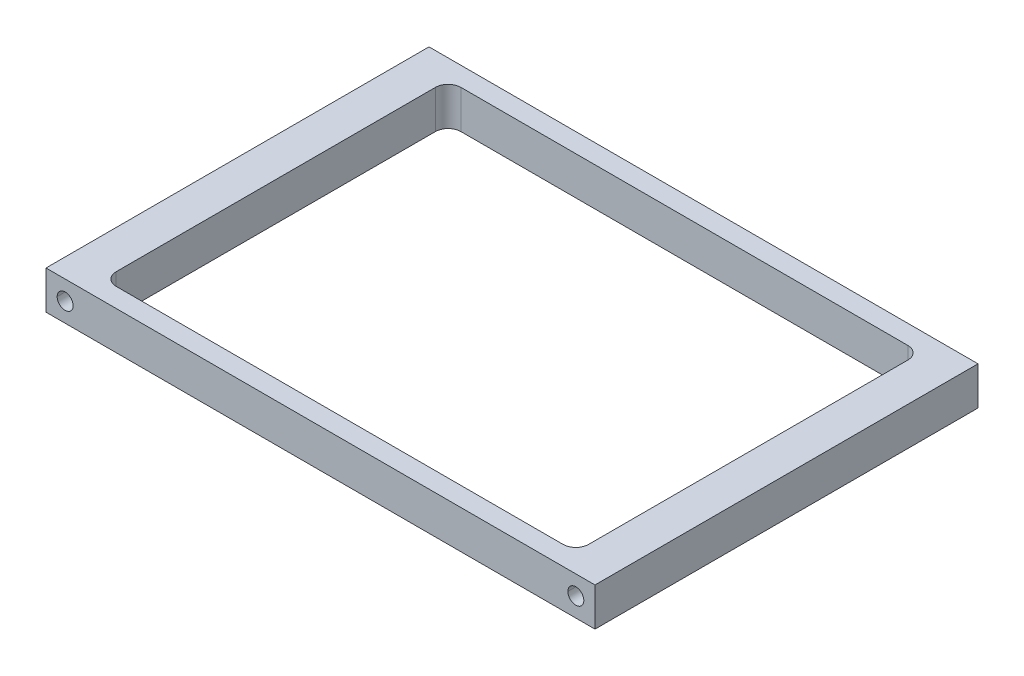
ISO-10303-21;
HEADER;
FILE_DESCRIPTION(('STEP AP214'),'2;1');
FILE_NAME('part.step','',(''),(''),'','','');
FILE_SCHEMA(('AUTOMOTIVE_DESIGN { 1 0 10303 214 1 1 1 1 }'));
ENDSEC;
DATA;
#1=APPLICATION_CONTEXT('core data for automotive mechanical design processes');
#2=APPLICATION_PROTOCOL_DEFINITION('international standard','automotive_design',2000,#1);
#3=PRODUCT_CONTEXT('',#1,'mechanical');
#4=PRODUCT('Part','Part','',(#3));
#5=PRODUCT_RELATED_PRODUCT_CATEGORY('part','',(#4));
#6=PRODUCT_DEFINITION_FORMATION('','',#4);
#7=PRODUCT_DEFINITION_CONTEXT('part definition',#1,'design');
#8=PRODUCT_DEFINITION('design','',#6,#7);
#9=PRODUCT_DEFINITION_SHAPE('','',#8);
#10=(LENGTH_UNIT() NAMED_UNIT(*) SI_UNIT(.MILLI.,.METRE.));
#11=(NAMED_UNIT(*) PLANE_ANGLE_UNIT() SI_UNIT($,.RADIAN.));
#12=(NAMED_UNIT(*) SI_UNIT($,.STERADIAN.) SOLID_ANGLE_UNIT());
#13=UNCERTAINTY_MEASURE_WITH_UNIT(LENGTH_MEASURE(1.E-05),#10,'distance_accuracy_value','');
#14=(GEOMETRIC_REPRESENTATION_CONTEXT(3) GLOBAL_UNCERTAINTY_ASSIGNED_CONTEXT((#13)) GLOBAL_UNIT_ASSIGNED_CONTEXT((#10,
#11,#12)) REPRESENTATION_CONTEXT('',''));
#15=CARTESIAN_POINT('',(0.,0.,0.));
#16=DIRECTION('',(0.,0.,1.));
#17=DIRECTION('',(1.,0.,0.));
#18=AXIS2_PLACEMENT_3D('',#15,#16,#17);
#19=CARTESIAN_POINT('',(-35.,0.,-25.));
#20=DIRECTION('',(0.,-1.,0.));
#21=DIRECTION('',(0.,0.,-1.));
#22=AXIS2_PLACEMENT_3D('',#19,#20,#21);
#23=CYLINDRICAL_SURFACE('',#22,2.);
#24=CARTESIAN_POINT('',(-35.,0.,-25.));
#25=DIRECTION('',(0.,1.,0.));
#26=DIRECTION('',(0.,0.,-1.));
#27=AXIS2_PLACEMENT_3D('',#24,#25,#26);
#28=CIRCLE('',#27,2.);
#29=CARTESIAN_POINT('',(-35.,0.,-27.));
#30=VERTEX_POINT('',#29);
#31=CARTESIAN_POINT('',(-37.,0.,-25.));
#32=VERTEX_POINT('',#31);
#33=EDGE_CURVE('E376',#30,#32,#28,.T.);
#34=ORIENTED_EDGE('',*,*,#33,.F.);
#35=DIRECTION('',(0.,-1.,0.));
#36=VECTOR('',#35,1.);
#37=CARTESIAN_POINT('',(-35.,0.,-27.));
#38=LINE('',#37,#36);
#39=CARTESIAN_POINT('',(-35.,6.,-27.));
#40=VERTEX_POINT('',#39);
#41=EDGE_CURVE('E10',#40,#30,#38,.T.);
#42=ORIENTED_EDGE('',*,*,#41,.F.);
#43=CARTESIAN_POINT('',(-35.,6.,-25.));
#44=DIRECTION('',(0.,-1.,0.));
#45=DIRECTION('',(0.,0.,-1.));
#46=AXIS2_PLACEMENT_3D('',#43,#44,#45);
#47=CIRCLE('',#46,2.);
#48=CARTESIAN_POINT('',(-37.,6.,-25.));
#49=VERTEX_POINT('',#48);
#50=EDGE_CURVE('E441',#49,#40,#47,.T.);
#51=ORIENTED_EDGE('',*,*,#50,.F.);
#52=DIRECTION('',(0.,1.,0.));
#53=VECTOR('',#52,1.);
#54=CARTESIAN_POINT('',(-37.,6.,-25.));
#55=LINE('',#54,#53);
#56=EDGE_CURVE('E50',#32,#49,#55,.T.);
#57=ORIENTED_EDGE('',*,*,#56,.F.);
#58=EDGE_LOOP('',(#34,#42,#51,#57));
#59=FACE_BOUND('',#58,.T.);
#60=ADVANCED_FACE('F16',(#59),#23,.F.);
#61=CARTESIAN_POINT('',(35.,0.,-25.));
#62=DIRECTION('',(0.,-1.,0.));
#63=DIRECTION('',(0.,0.,-1.));
#64=AXIS2_PLACEMENT_3D('',#61,#62,#63);
#65=CYLINDRICAL_SURFACE('',#64,2.);
#66=CARTESIAN_POINT('',(35.,0.,-25.));
#67=DIRECTION('',(0.,1.,0.));
#68=DIRECTION('',(0.,0.,-1.));
#69=AXIS2_PLACEMENT_3D('',#66,#67,#68);
#70=CIRCLE('',#69,2.);
#71=CARTESIAN_POINT('',(37.,0.,-25.));
#72=VERTEX_POINT('',#71);
#73=CARTESIAN_POINT('',(35.,0.,-27.));
#74=VERTEX_POINT('',#73);
#75=EDGE_CURVE('E415',#72,#74,#70,.T.);
#76=ORIENTED_EDGE('',*,*,#75,.F.);
#77=DIRECTION('',(0.,-1.,0.));
#78=VECTOR('',#77,1.);
#79=CARTESIAN_POINT('',(37.,0.,-25.));
#80=LINE('',#79,#78);
#81=CARTESIAN_POINT('',(37.,6.,-25.));
#82=VERTEX_POINT('',#81);
#83=EDGE_CURVE('E321',#82,#72,#80,.T.);
#84=ORIENTED_EDGE('',*,*,#83,.F.);
#85=CARTESIAN_POINT('',(35.,6.,-25.));
#86=DIRECTION('',(0.,-1.,0.));
#87=DIRECTION('',(0.,0.,-1.));
#88=AXIS2_PLACEMENT_3D('',#85,#86,#87);
#89=CIRCLE('',#88,2.);
#90=CARTESIAN_POINT('',(35.,6.,-27.));
#91=VERTEX_POINT('',#90);
#92=EDGE_CURVE('E265',#91,#82,#89,.T.);
#93=ORIENTED_EDGE('',*,*,#92,.F.);
#94=DIRECTION('',(0.,1.,0.));
#95=VECTOR('',#94,1.);
#96=CARTESIAN_POINT('',(35.,6.,-27.));
#97=LINE('',#96,#95);
#98=EDGE_CURVE('E20',#74,#91,#97,.T.);
#99=ORIENTED_EDGE('',*,*,#98,.F.);
#100=EDGE_LOOP('',(#76,#84,#93,#99));
#101=FACE_BOUND('',#100,.T.);
#102=ADVANCED_FACE('F18',(#101),#65,.F.);
#103=CARTESIAN_POINT('',(-35.,0.,25.));
#104=DIRECTION('',(0.,-1.,0.));
#105=DIRECTION('',(0.,0.,-1.));
#106=AXIS2_PLACEMENT_3D('',#103,#104,#105);
#107=CYLINDRICAL_SURFACE('',#106,2.);
#108=CARTESIAN_POINT('',(-35.,0.,25.));
#109=DIRECTION('',(0.,1.,0.));
#110=DIRECTION('',(0.,0.,-1.));
#111=AXIS2_PLACEMENT_3D('',#108,#109,#110);
#112=CIRCLE('',#111,2.);
#113=CARTESIAN_POINT('',(-37.,0.,25.));
#114=VERTEX_POINT('',#113);
#115=CARTESIAN_POINT('',(-35.,0.,27.));
#116=VERTEX_POINT('',#115);
#117=EDGE_CURVE('E460',#114,#116,#112,.T.);
#118=ORIENTED_EDGE('',*,*,#117,.F.);
#119=DIRECTION('',(0.,-1.,0.));
#120=VECTOR('',#119,1.);
#121=CARTESIAN_POINT('',(-37.,0.,25.));
#122=LINE('',#121,#120);
#123=CARTESIAN_POINT('',(-37.,6.,25.));
#124=VERTEX_POINT('',#123);
#125=EDGE_CURVE('E39',#124,#114,#122,.T.);
#126=ORIENTED_EDGE('',*,*,#125,.F.);
#127=CARTESIAN_POINT('',(-35.,6.,25.));
#128=DIRECTION('',(0.,-1.,0.));
#129=DIRECTION('',(0.,0.,-1.));
#130=AXIS2_PLACEMENT_3D('',#127,#128,#129);
#131=CIRCLE('',#130,2.);
#132=CARTESIAN_POINT('',(-35.,6.,27.));
#133=VERTEX_POINT('',#132);
#134=EDGE_CURVE('E427',#133,#124,#131,.T.);
#135=ORIENTED_EDGE('',*,*,#134,.F.);
#136=DIRECTION('',(0.,1.,0.));
#137=VECTOR('',#136,1.);
#138=CARTESIAN_POINT('',(-35.,6.,27.));
#139=LINE('',#138,#137);
#140=EDGE_CURVE('E332',#116,#133,#139,.T.);
#141=ORIENTED_EDGE('',*,*,#140,.F.);
#142=EDGE_LOOP('',(#118,#126,#135,#141));
#143=FACE_BOUND('',#142,.T.);
#144=ADVANCED_FACE('F504',(#143),#107,.F.);
#145=CARTESIAN_POINT('',(35.,0.,25.));
#146=DIRECTION('',(0.,-1.,0.));
#147=DIRECTION('',(0.,0.,-1.));
#148=AXIS2_PLACEMENT_3D('',#145,#146,#147);
#149=CYLINDRICAL_SURFACE('',#148,2.);
#150=CARTESIAN_POINT('',(35.,0.,25.));
#151=DIRECTION('',(0.,1.,0.));
#152=DIRECTION('',(0.,0.,-1.));
#153=AXIS2_PLACEMENT_3D('',#150,#151,#152);
#154=CIRCLE('',#153,2.);
#155=CARTESIAN_POINT('',(35.,0.,27.));
#156=VERTEX_POINT('',#155);
#157=CARTESIAN_POINT('',(37.,0.,25.));
#158=VERTEX_POINT('',#157);
#159=EDGE_CURVE('E438',#156,#158,#154,.T.);
#160=ORIENTED_EDGE('',*,*,#159,.F.);
#161=DIRECTION('',(0.,-1.,0.));
#162=VECTOR('',#161,1.);
#163=CARTESIAN_POINT('',(35.,0.,27.));
#164=LINE('',#163,#162);
#165=CARTESIAN_POINT('',(35.,6.,27.));
#166=VERTEX_POINT('',#165);
#167=EDGE_CURVE('E432',#166,#156,#164,.T.);
#168=ORIENTED_EDGE('',*,*,#167,.F.);
#169=CARTESIAN_POINT('',(35.,6.,25.));
#170=DIRECTION('',(0.,-1.,0.));
#171=DIRECTION('',(0.,0.,-1.));
#172=AXIS2_PLACEMENT_3D('',#169,#170,#171);
#173=CIRCLE('',#172,2.);
#174=CARTESIAN_POINT('',(37.,6.,25.));
#175=VERTEX_POINT('',#174);
#176=EDGE_CURVE('E394',#175,#166,#173,.T.);
#177=ORIENTED_EDGE('',*,*,#176,.F.);
#178=DIRECTION('',(0.,1.,0.));
#179=VECTOR('',#178,1.);
#180=CARTESIAN_POINT('',(37.,6.,25.));
#181=LINE('',#180,#179);
#182=EDGE_CURVE('E230',#158,#175,#181,.T.);
#183=ORIENTED_EDGE('',*,*,#182,.F.);
#184=EDGE_LOOP('',(#160,#168,#177,#183));
#185=FACE_BOUND('',#184,.T.);
#186=ADVANCED_FACE('F498',(#185),#149,.F.);
#187=CARTESIAN_POINT('',(-37.,0.,-27.));
#188=DIRECTION('',(0.,0.,-1.));
#189=DIRECTION('',(0.,-1.,0.));
#190=AXIS2_PLACEMENT_3D('',#187,#188,#189);
#191=PLANE('',#190);
#192=DIRECTION('',(-1.,0.,0.));
#193=VECTOR('',#192,1.);
#194=CARTESIAN_POINT('',(-37.,0.,-27.));
#195=LINE('',#194,#193);
#196=EDGE_CURVE('E381',#74,#30,#195,.T.);
#197=ORIENTED_EDGE('',*,*,#196,.F.);
#198=ORIENTED_EDGE('',*,*,#98,.T.);
#199=DIRECTION('',(-1.,0.,0.));
#200=VECTOR('',#199,1.);
#201=CARTESIAN_POINT('',(-37.,6.,-27.));
#202=LINE('',#201,#200);
#203=EDGE_CURVE('E263',#91,#40,#202,.T.);
#204=ORIENTED_EDGE('',*,*,#203,.T.);
#205=ORIENTED_EDGE('',*,*,#41,.T.);
#206=EDGE_LOOP('',(#197,#198,#204,#205));
#207=FACE_BOUND('',#206,.T.);
#208=ADVANCED_FACE('F479',(#207),#191,.F.);
#209=CARTESIAN_POINT('',(-37.,0.,27.));
#210=DIRECTION('',(-1.,0.,0.));
#211=DIRECTION('',(0.,0.,1.));
#212=AXIS2_PLACEMENT_3D('',#209,#210,#211);
#213=PLANE('',#212);
#214=DIRECTION('',(0.,0.,1.));
#215=VECTOR('',#214,1.);
#216=CARTESIAN_POINT('',(-37.,6.,27.));
#217=LINE('',#216,#215);
#218=EDGE_CURVE('E431',#49,#124,#217,.T.);
#219=ORIENTED_EDGE('',*,*,#218,.T.);
#220=ORIENTED_EDGE('',*,*,#125,.T.);
#221=DIRECTION('',(0.,0.,1.));
#222=VECTOR('',#221,1.);
#223=CARTESIAN_POINT('',(-37.,0.,27.));
#224=LINE('',#223,#222);
#225=EDGE_CURVE('E380',#32,#114,#224,.T.);
#226=ORIENTED_EDGE('',*,*,#225,.F.);
#227=ORIENTED_EDGE('',*,*,#56,.T.);
#228=EDGE_LOOP('',(#219,#220,#226,#227));
#229=FACE_BOUND('',#228,.T.);
#230=ADVANCED_FACE('F505',(#229),#213,.F.);
#231=CARTESIAN_POINT('',(-37.,0.,27.));
#232=DIRECTION('',(0.,0.,1.));
#233=DIRECTION('',(1.,0.,0.));
#234=AXIS2_PLACEMENT_3D('',#231,#232,#233);
#235=PLANE('',#234);
#236=DIRECTION('',(1.,0.,0.));
#237=VECTOR('',#236,1.);
#238=CARTESIAN_POINT('',(-37.,6.,27.));
#239=LINE('',#238,#237);
#240=EDGE_CURVE('E423',#133,#166,#239,.T.);
#241=ORIENTED_EDGE('',*,*,#240,.T.);
#242=ORIENTED_EDGE('',*,*,#167,.T.);
#243=DIRECTION('',(1.,0.,0.));
#244=VECTOR('',#243,1.);
#245=CARTESIAN_POINT('',(-37.,0.,27.));
#246=LINE('',#245,#244);
#247=EDGE_CURVE('E447',#116,#156,#246,.T.);
#248=ORIENTED_EDGE('',*,*,#247,.F.);
#249=ORIENTED_EDGE('',*,*,#140,.T.);
#250=EDGE_LOOP('',(#241,#242,#248,#249));
#251=FACE_BOUND('',#250,.T.);
#252=ADVANCED_FACE('F501',(#251),#235,.F.);
#253=CARTESIAN_POINT('',(37.,0.,27.));
#254=DIRECTION('',(1.,0.,0.));
#255=DIRECTION('',(0.,1.,0.));
#256=AXIS2_PLACEMENT_3D('',#253,#254,#255);
#257=PLANE('',#256);
#258=DIRECTION('',(0.,0.,-1.));
#259=VECTOR('',#258,1.);
#260=CARTESIAN_POINT('',(37.,0.,27.));
#261=LINE('',#260,#259);
#262=EDGE_CURVE('E419',#158,#72,#261,.T.);
#263=ORIENTED_EDGE('',*,*,#262,.F.);
#264=ORIENTED_EDGE('',*,*,#182,.T.);
#265=DIRECTION('',(0.,0.,-1.));
#266=VECTOR('',#265,1.);
#267=CARTESIAN_POINT('',(37.,6.,27.));
#268=LINE('',#267,#266);
#269=EDGE_CURVE('E390',#175,#82,#268,.T.);
#270=ORIENTED_EDGE('',*,*,#269,.T.);
#271=ORIENTED_EDGE('',*,*,#83,.T.);
#272=EDGE_LOOP('',(#263,#264,#270,#271));
#273=FACE_BOUND('',#272,.T.);
#274=ADVANCED_FACE('F494',(#273),#257,.F.);
#275=CARTESIAN_POINT('',(-40.,3.,-30.));
#276=DIRECTION('',(0.,0.,-1.));
#277=DIRECTION('',(-1.,0.,0.));
#278=AXIS2_PLACEMENT_3D('',#275,#276,#277);
#279=CYLINDRICAL_SURFACE('',#278,1.25);
#280=DIRECTION('',(0.,0.,-1.));
#281=VECTOR('',#280,1.);
#282=CARTESIAN_POINT('',(-38.75,3.,-30.));
#283=LINE('',#282,#281);
#284=CARTESIAN_POINT('',(-38.75,3.,-14.));
#285=VERTEX_POINT('',#284);
#286=CARTESIAN_POINT('',(-38.75,3.,-30.));
#287=VERTEX_POINT('',#286);
#288=EDGE_CURVE('E242',#285,#287,#283,.T.);
#289=ORIENTED_EDGE('',*,*,#288,.F.);
#290=CARTESIAN_POINT('',(-40.,3.,-14.));
#291=DIRECTION('',(0.,0.,-1.));
#292=DIRECTION('',(-1.,0.,0.));
#293=AXIS2_PLACEMENT_3D('',#290,#291,#292);
#294=CIRCLE('',#293,1.25);
#295=CARTESIAN_POINT('',(-41.25,3.,-14.));
#296=VERTEX_POINT('',#295);
#297=EDGE_CURVE('E219',#296,#285,#294,.T.);
#298=ORIENTED_EDGE('',*,*,#297,.F.);
#299=DIRECTION('',(0.,0.,-1.));
#300=VECTOR('',#299,1.);
#301=CARTESIAN_POINT('',(-41.25,3.,-30.));
#302=LINE('',#301,#300);
#303=CARTESIAN_POINT('',(-41.25,3.,-30.));
#304=VERTEX_POINT('',#303);
#305=EDGE_CURVE('E252',#296,#304,#302,.T.);
#306=ORIENTED_EDGE('',*,*,#305,.T.);
#307=CARTESIAN_POINT('',(-40.,3.,-30.));
#308=DIRECTION('',(0.,0.,-1.));
#309=DIRECTION('',(-1.,0.,0.));
#310=AXIS2_PLACEMENT_3D('',#307,#308,#309);
#311=CIRCLE('',#310,1.24999999999999);
#312=EDGE_CURVE('E244',#304,#287,#311,.T.);
#313=ORIENTED_EDGE('',*,*,#312,.T.);
#314=EDGE_LOOP('',(#289,#298,#306,#313));
#315=FACE_BOUND('',#314,.T.);
#316=ADVANCED_FACE('F243',(#315),#279,.F.);
#317=CARTESIAN_POINT('',(-40.,3.,-14.));
#318=DIRECTION('',(0.,0.,-1.));
#319=DIRECTION('',(-1.,0.,0.));
#320=AXIS2_PLACEMENT_3D('',#317,#318,#319);
#321=CONICAL_SURFACE('',#320,1.25,1.02974425867665);
#322=DIRECTION('',(0.85716730070211,0.,-0.515038074910058));
#323=VECTOR('',#322,1.);
#324=CARTESIAN_POINT('',(-38.75,3.,-14.));
#325=LINE('',#324,#323);
#326=CARTESIAN_POINT('',(-40.,3.,-13.2489242262155));
#327=VERTEX_POINT('',#326);
#328=EDGE_CURVE('E222',#327,#285,#325,.T.);
#329=ORIENTED_EDGE('',*,*,#328,.F.);
#330=DIRECTION('',(-0.85716730070211,0.,-0.515038074910058));
#331=VECTOR('',#330,1.);
#332=CARTESIAN_POINT('',(-41.25,3.,-14.));
#333=LINE('',#332,#331);
#334=EDGE_CURVE('E224',#327,#296,#333,.T.);
#335=ORIENTED_EDGE('',*,*,#334,.T.);
#336=ORIENTED_EDGE('',*,*,#297,.T.);
#337=EDGE_LOOP('',(#329,#335,#336));
#338=FACE_BOUND('',#337,.T.);
#339=ADVANCED_FACE('F221',(#338),#321,.F.);
#340=CARTESIAN_POINT('',(40.,3.,-30.));
#341=DIRECTION('',(0.,0.,-1.));
#342=DIRECTION('',(-1.,0.,0.));
#343=AXIS2_PLACEMENT_3D('',#340,#341,#342);
#344=CYLINDRICAL_SURFACE('',#343,1.25);
#345=DIRECTION('',(0.,0.,-1.));
#346=VECTOR('',#345,1.);
#347=CARTESIAN_POINT('',(41.25,3.,-30.));
#348=LINE('',#347,#346);
#349=CARTESIAN_POINT('',(41.25,3.,-14.));
#350=VERTEX_POINT('',#349);
#351=CARTESIAN_POINT('',(41.25,3.,-30.));
#352=VERTEX_POINT('',#351);
#353=EDGE_CURVE('E299',#350,#352,#348,.T.);
#354=ORIENTED_EDGE('',*,*,#353,.F.);
#355=CARTESIAN_POINT('',(40.,3.,-14.));
#356=DIRECTION('',(0.,0.,-1.));
#357=DIRECTION('',(-1.,0.,0.));
#358=AXIS2_PLACEMENT_3D('',#355,#356,#357);
#359=CIRCLE('',#358,1.25);
#360=CARTESIAN_POINT('',(38.75,3.,-14.));
#361=VERTEX_POINT('',#360);
#362=EDGE_CURVE('E231',#361,#350,#359,.T.);
#363=ORIENTED_EDGE('',*,*,#362,.F.);
#364=DIRECTION('',(0.,0.,-1.));
#365=VECTOR('',#364,1.);
#366=CARTESIAN_POINT('',(38.75,3.,-30.));
#367=LINE('',#366,#365);
#368=CARTESIAN_POINT('',(38.75,3.,-30.));
#369=VERTEX_POINT('',#368);
#370=EDGE_CURVE('E280',#361,#369,#367,.T.);
#371=ORIENTED_EDGE('',*,*,#370,.T.);
#372=CARTESIAN_POINT('',(40.,3.,-30.));
#373=DIRECTION('',(0.,0.,-1.));
#374=DIRECTION('',(-1.,0.,0.));
#375=AXIS2_PLACEMENT_3D('',#372,#373,#374);
#376=CIRCLE('',#375,1.24999999999999);
#377=EDGE_CURVE('E364',#369,#352,#376,.T.);
#378=ORIENTED_EDGE('',*,*,#377,.T.);
#379=EDGE_LOOP('',(#354,#363,#371,#378));
#380=FACE_BOUND('',#379,.T.);
#381=ADVANCED_FACE('F532',(#380),#344,.F.);
#382=CARTESIAN_POINT('',(40.,3.,-14.));
#383=DIRECTION('',(0.,0.,-1.));
#384=DIRECTION('',(-1.,0.,0.));
#385=AXIS2_PLACEMENT_3D('',#382,#383,#384);
#386=CONICAL_SURFACE('',#385,1.25,1.02974425867665);
#387=DIRECTION('',(0.85716730070211,0.,-0.515038074910058));
#388=VECTOR('',#387,1.);
#389=CARTESIAN_POINT('',(41.25,3.,-14.));
#390=LINE('',#389,#388);
#391=CARTESIAN_POINT('',(40.,3.,-13.2489242262155));
#392=VERTEX_POINT('',#391);
#393=EDGE_CURVE('E273',#392,#350,#390,.T.);
#394=ORIENTED_EDGE('',*,*,#393,.F.);
#395=DIRECTION('',(-0.85716730070211,0.,-0.515038074910058));
#396=VECTOR('',#395,1.);
#397=CARTESIAN_POINT('',(38.75,3.,-14.));
#398=LINE('',#397,#396);
#399=EDGE_CURVE('E284',#392,#361,#398,.T.);
#400=ORIENTED_EDGE('',*,*,#399,.T.);
#401=ORIENTED_EDGE('',*,*,#362,.T.);
#402=EDGE_LOOP('',(#394,#400,#401));
#403=FACE_BOUND('',#402,.T.);
#404=ADVANCED_FACE('F528',(#403),#386,.F.);
#405=CARTESIAN_POINT('',(-40.,3.,30.));
#406=DIRECTION('',(0.,0.,1.));
#407=DIRECTION('',(1.,0.,0.));
#408=AXIS2_PLACEMENT_3D('',#405,#406,#407);
#409=CYLINDRICAL_SURFACE('',#408,1.25);
#410=DIRECTION('',(0.,0.,1.));
#411=VECTOR('',#410,1.);
#412=CARTESIAN_POINT('',(-41.25,3.,30.));
#413=LINE('',#412,#411);
#414=CARTESIAN_POINT('',(-41.25,3.,14.));
#415=VERTEX_POINT('',#414);
#416=CARTESIAN_POINT('',(-41.25,3.,30.));
#417=VERTEX_POINT('',#416);
#418=EDGE_CURVE('E272',#415,#417,#413,.T.);
#419=ORIENTED_EDGE('',*,*,#418,.F.);
#420=CARTESIAN_POINT('',(-40.,3.,14.));
#421=DIRECTION('',(0.,0.,1.));
#422=DIRECTION('',(1.,0.,0.));
#423=AXIS2_PLACEMENT_3D('',#420,#421,#422);
#424=CIRCLE('',#423,1.25);
#425=CARTESIAN_POINT('',(-38.75,3.,14.));
#426=VERTEX_POINT('',#425);
#427=EDGE_CURVE('E286',#426,#415,#424,.T.);
#428=ORIENTED_EDGE('',*,*,#427,.F.);
#429=DIRECTION('',(0.,0.,1.));
#430=VECTOR('',#429,1.);
#431=CARTESIAN_POINT('',(-38.75,3.,30.));
#432=LINE('',#431,#430);
#433=CARTESIAN_POINT('',(-38.75,3.,30.));
#434=VERTEX_POINT('',#433);
#435=EDGE_CURVE('E312',#426,#434,#432,.T.);
#436=ORIENTED_EDGE('',*,*,#435,.T.);
#437=CARTESIAN_POINT('',(-40.,3.,30.));
#438=DIRECTION('',(0.,0.,1.));
#439=DIRECTION('',(1.,0.,0.));
#440=AXIS2_PLACEMENT_3D('',#437,#438,#439);
#441=CIRCLE('',#440,1.24999999999999);
#442=EDGE_CURVE('E306',#434,#417,#441,.T.);
#443=ORIENTED_EDGE('',*,*,#442,.T.);
#444=EDGE_LOOP('',(#419,#428,#436,#443));
#445=FACE_BOUND('',#444,.T.);
#446=ADVANCED_FACE('F525',(#445),#409,.F.);
#447=CARTESIAN_POINT('',(-40.,3.,14.));
#448=DIRECTION('',(0.,0.,1.));
#449=DIRECTION('',(1.,0.,0.));
#450=AXIS2_PLACEMENT_3D('',#447,#448,#449);
#451=CONICAL_SURFACE('',#450,1.25,1.02974425867665);
#452=DIRECTION('',(-0.85716730070211,0.,0.515038074910058));
#453=VECTOR('',#452,1.);
#454=CARTESIAN_POINT('',(-41.25,3.,14.));
#455=LINE('',#454,#453);
#456=CARTESIAN_POINT('',(-40.,3.,13.2489242262155));
#457=VERTEX_POINT('',#456);
#458=EDGE_CURVE('E329',#457,#415,#455,.T.);
#459=ORIENTED_EDGE('',*,*,#458,.F.);
#460=DIRECTION('',(0.85716730070211,0.,0.515038074910058));
#461=VECTOR('',#460,1.);
#462=CARTESIAN_POINT('',(-38.75,3.,14.));
#463=LINE('',#462,#461);
#464=EDGE_CURVE('E325',#457,#426,#463,.T.);
#465=ORIENTED_EDGE('',*,*,#464,.T.);
#466=ORIENTED_EDGE('',*,*,#427,.T.);
#467=EDGE_LOOP('',(#459,#465,#466));
#468=FACE_BOUND('',#467,.T.);
#469=ADVANCED_FACE('F523',(#468),#451,.F.);
#470=CARTESIAN_POINT('',(40.,3.,30.));
#471=DIRECTION('',(0.,0.,1.));
#472=DIRECTION('',(1.,0.,0.));
#473=AXIS2_PLACEMENT_3D('',#470,#471,#472);
#474=CYLINDRICAL_SURFACE('',#473,1.25);
#475=DIRECTION('',(0.,0.,1.));
#476=VECTOR('',#475,1.);
#477=CARTESIAN_POINT('',(38.75,3.,30.));
#478=LINE('',#477,#476);
#479=CARTESIAN_POINT('',(38.75,3.,14.));
#480=VERTEX_POINT('',#479);
#481=CARTESIAN_POINT('',(38.75,3.,30.));
#482=VERTEX_POINT('',#481);
#483=EDGE_CURVE('E290',#480,#482,#478,.T.);
#484=ORIENTED_EDGE('',*,*,#483,.F.);
#485=CARTESIAN_POINT('',(40.,3.,14.));
#486=DIRECTION('',(0.,0.,1.));
#487=DIRECTION('',(1.,0.,0.));
#488=AXIS2_PLACEMENT_3D('',#485,#486,#487);
#489=CIRCLE('',#488,1.25);
#490=CARTESIAN_POINT('',(41.25,3.,14.));
#491=VERTEX_POINT('',#490);
#492=EDGE_CURVE('E289',#491,#480,#489,.T.);
#493=ORIENTED_EDGE('',*,*,#492,.F.);
#494=DIRECTION('',(0.,0.,1.));
#495=VECTOR('',#494,1.);
#496=CARTESIAN_POINT('',(41.25,3.,30.));
#497=LINE('',#496,#495);
#498=CARTESIAN_POINT('',(41.25,3.,30.));
#499=VERTEX_POINT('',#498);
#500=EDGE_CURVE('E261',#491,#499,#497,.T.);
#501=ORIENTED_EDGE('',*,*,#500,.T.);
#502=CARTESIAN_POINT('',(40.,3.,30.));
#503=DIRECTION('',(0.,0.,1.));
#504=DIRECTION('',(1.,0.,0.));
#505=AXIS2_PLACEMENT_3D('',#502,#503,#504);
#506=CIRCLE('',#505,1.24999999999999);
#507=EDGE_CURVE('E266',#499,#482,#506,.T.);
#508=ORIENTED_EDGE('',*,*,#507,.T.);
#509=EDGE_LOOP('',(#484,#493,#501,#508));
#510=FACE_BOUND('',#509,.T.);
#511=ADVANCED_FACE('F573',(#510),#474,.F.);
#512=CARTESIAN_POINT('',(40.,3.,14.));
#513=DIRECTION('',(0.,0.,1.));
#514=DIRECTION('',(1.,0.,0.));
#515=AXIS2_PLACEMENT_3D('',#512,#513,#514);
#516=CONICAL_SURFACE('',#515,1.25,1.02974425867665);
#517=DIRECTION('',(-0.85716730070211,0.,0.515038074910058));
#518=VECTOR('',#517,1.);
#519=CARTESIAN_POINT('',(38.75,3.,14.));
#520=LINE('',#519,#518);
#521=CARTESIAN_POINT('',(40.,3.,13.2489242262155));
#522=VERTEX_POINT('',#521);
#523=EDGE_CURVE('E351',#522,#480,#520,.T.);
#524=ORIENTED_EDGE('',*,*,#523,.F.);
#525=DIRECTION('',(0.85716730070211,0.,0.515038074910058));
#526=VECTOR('',#525,1.);
#527=CARTESIAN_POINT('',(41.25,3.,14.));
#528=LINE('',#527,#526);
#529=EDGE_CURVE('E347',#522,#491,#528,.T.);
#530=ORIENTED_EDGE('',*,*,#529,.T.);
#531=ORIENTED_EDGE('',*,*,#492,.T.);
#532=EDGE_LOOP('',(#524,#530,#531));
#533=FACE_BOUND('',#532,.T.);
#534=ADVANCED_FACE('F580',(#533),#516,.F.);
#535=CARTESIAN_POINT('',(0.,0.,0.));
#536=DIRECTION('',(0.,-1.,0.));
#537=DIRECTION('',(0.,0.,-1.));
#538=AXIS2_PLACEMENT_3D('',#535,#536,#537);
#539=PLANE('',#538);
#540=ORIENTED_EDGE('',*,*,#247,.T.);
#541=ORIENTED_EDGE('',*,*,#159,.T.);
#542=ORIENTED_EDGE('',*,*,#262,.T.);
#543=ORIENTED_EDGE('',*,*,#75,.T.);
#544=ORIENTED_EDGE('',*,*,#196,.T.);
#545=ORIENTED_EDGE('',*,*,#33,.T.);
#546=ORIENTED_EDGE('',*,*,#225,.T.);
#547=ORIENTED_EDGE('',*,*,#117,.T.);
#548=EDGE_LOOP('',(#540,#541,#542,#543,#544,#545,#546,#547));
#549=FACE_BOUND('',#548,.T.);
#550=DIRECTION('',(0.,0.,-1.));
#551=VECTOR('',#550,1.);
#552=CARTESIAN_POINT('',(43.,0.,30.));
#553=LINE('',#552,#551);
#554=CARTESIAN_POINT('',(43.,0.,30.));
#555=VERTEX_POINT('',#554);
#556=CARTESIAN_POINT('',(43.,0.,-30.));
#557=VERTEX_POINT('',#556);
#558=EDGE_CURVE('E355',#555,#557,#553,.T.);
#559=ORIENTED_EDGE('',*,*,#558,.F.);
#560=DIRECTION('',(1.,0.,0.));
#561=VECTOR('',#560,1.);
#562=CARTESIAN_POINT('',(-43.,0.,30.));
#563=LINE('',#562,#561);
#564=CARTESIAN_POINT('',(-43.,0.,30.));
#565=VERTEX_POINT('',#564);
#566=EDGE_CURVE('E307',#565,#555,#563,.T.);
#567=ORIENTED_EDGE('',*,*,#566,.F.);
#568=DIRECTION('',(0.,0.,1.));
#569=VECTOR('',#568,1.);
#570=CARTESIAN_POINT('',(-43.,0.,30.));
#571=LINE('',#570,#569);
#572=CARTESIAN_POINT('',(-43.,0.,-30.));
#573=VERTEX_POINT('',#572);
#574=EDGE_CURVE('E367',#573,#565,#571,.T.);
#575=ORIENTED_EDGE('',*,*,#574,.F.);
#576=DIRECTION('',(-1.,0.,0.));
#577=VECTOR('',#576,1.);
#578=CARTESIAN_POINT('',(-43.,0.,-30.));
#579=LINE('',#578,#577);
#580=EDGE_CURVE('E375',#557,#573,#579,.T.);
#581=ORIENTED_EDGE('',*,*,#580,.F.);
#582=EDGE_LOOP('',(#559,#567,#575,#581));
#583=FACE_BOUND('',#582,.T.);
#584=ADVANCED_FACE('F489',(#549,#583),#539,.T.);
#585=CARTESIAN_POINT('',(0.,6.,0.));
#586=DIRECTION('',(0.,-1.,0.));
#587=DIRECTION('',(0.,0.,-1.));
#588=AXIS2_PLACEMENT_3D('',#585,#586,#587);
#589=PLANE('',#588);
#590=ORIENTED_EDGE('',*,*,#203,.F.);
#591=ORIENTED_EDGE('',*,*,#92,.T.);
#592=ORIENTED_EDGE('',*,*,#269,.F.);
#593=ORIENTED_EDGE('',*,*,#176,.T.);
#594=ORIENTED_EDGE('',*,*,#240,.F.);
#595=ORIENTED_EDGE('',*,*,#134,.T.);
#596=ORIENTED_EDGE('',*,*,#218,.F.);
#597=ORIENTED_EDGE('',*,*,#50,.T.);
#598=EDGE_LOOP('',(#590,#591,#592,#593,#594,#595,#596,#597));
#599=FACE_BOUND('',#598,.T.);
#600=DIRECTION('',(0.,0.,-1.));
#601=VECTOR('',#600,1.);
#602=CARTESIAN_POINT('',(43.,6.,30.));
#603=LINE('',#602,#601);
#604=CARTESIAN_POINT('',(43.,6.,30.));
#605=VERTEX_POINT('',#604);
#606=CARTESIAN_POINT('',(43.,6.,-30.));
#607=VERTEX_POINT('',#606);
#608=EDGE_CURVE('E363',#605,#607,#603,.T.);
#609=ORIENTED_EDGE('',*,*,#608,.T.);
#610=DIRECTION('',(-1.,0.,0.));
#611=VECTOR('',#610,1.);
#612=CARTESIAN_POINT('',(-43.,6.,-30.));
#613=LINE('',#612,#611);
#614=CARTESIAN_POINT('',(-43.,6.,-30.));
#615=VERTEX_POINT('',#614);
#616=EDGE_CURVE('E389',#607,#615,#613,.T.);
#617=ORIENTED_EDGE('',*,*,#616,.T.);
#618=DIRECTION('',(0.,0.,1.));
#619=VECTOR('',#618,1.);
#620=CARTESIAN_POINT('',(-43.,6.,30.));
#621=LINE('',#620,#619);
#622=CARTESIAN_POINT('',(-43.,6.,30.));
#623=VERTEX_POINT('',#622);
#624=EDGE_CURVE('E336',#615,#623,#621,.T.);
#625=ORIENTED_EDGE('',*,*,#624,.T.);
#626=DIRECTION('',(1.,0.,0.));
#627=VECTOR('',#626,1.);
#628=CARTESIAN_POINT('',(-43.,6.,30.));
#629=LINE('',#628,#627);
#630=EDGE_CURVE('E303',#623,#605,#629,.T.);
#631=ORIENTED_EDGE('',*,*,#630,.T.);
#632=EDGE_LOOP('',(#609,#617,#625,#631));
#633=FACE_BOUND('',#632,.T.);
#634=ADVANCED_FACE('F485',(#599,#633),#589,.F.);
#635=CARTESIAN_POINT('',(-43.,6.,30.));
#636=DIRECTION('',(0.,0.,-1.));
#637=DIRECTION('',(-1.,0.,0.));
#638=AXIS2_PLACEMENT_3D('',#635,#636,#637);
#639=PLANE('',#638);
#640=ORIENTED_EDGE('',*,*,#507,.F.);
#641=CARTESIAN_POINT('',(40.,3.,30.));
#642=DIRECTION('',(0.,0.,1.));
#643=DIRECTION('',(1.,0.,0.));
#644=AXIS2_PLACEMENT_3D('',#641,#642,#643);
#645=CIRCLE('',#644,1.24999999999999);
#646=EDGE_CURVE('E294',#482,#499,#645,.T.);
#647=ORIENTED_EDGE('',*,*,#646,.F.);
#648=EDGE_LOOP('',(#640,#647));
#649=FACE_BOUND('',#648,.T.);
#650=ORIENTED_EDGE('',*,*,#442,.F.);
#651=CARTESIAN_POINT('',(-40.,3.,30.));
#652=DIRECTION('',(0.,0.,1.));
#653=DIRECTION('',(1.,0.,0.));
#654=AXIS2_PLACEMENT_3D('',#651,#652,#653);
#655=CIRCLE('',#654,1.24999999999999);
#656=EDGE_CURVE('E308',#417,#434,#655,.T.);
#657=ORIENTED_EDGE('',*,*,#656,.F.);
#658=EDGE_LOOP('',(#650,#657));
#659=FACE_BOUND('',#658,.T.);
#660=ORIENTED_EDGE('',*,*,#566,.T.);
#661=DIRECTION('',(0.,-1.,0.));
#662=VECTOR('',#661,1.);
#663=CARTESIAN_POINT('',(43.,6.,30.));
#664=LINE('',#663,#662);
#665=EDGE_CURVE('E371',#605,#555,#664,.T.);
#666=ORIENTED_EDGE('',*,*,#665,.F.);
#667=ORIENTED_EDGE('',*,*,#630,.F.);
#668=DIRECTION('',(0.,-1.,0.));
#669=VECTOR('',#668,1.);
#670=CARTESIAN_POINT('',(-43.,6.,30.));
#671=LINE('',#670,#669);
#672=EDGE_CURVE('E340',#623,#565,#671,.T.);
#673=ORIENTED_EDGE('',*,*,#672,.T.);
#674=EDGE_LOOP('',(#660,#666,#667,#673));
#675=FACE_BOUND('',#674,.T.);
#676=ADVANCED_FACE('F600',(#649,#659,#675),#639,.F.);
#677=CARTESIAN_POINT('',(-43.,6.,30.));
#678=DIRECTION('',(1.,0.,0.));
#679=DIRECTION('',(0.,1.,0.));
#680=AXIS2_PLACEMENT_3D('',#677,#678,#679);
#681=PLANE('',#680);
#682=ORIENTED_EDGE('',*,*,#574,.T.);
#683=ORIENTED_EDGE('',*,*,#672,.F.);
#684=ORIENTED_EDGE('',*,*,#624,.F.);
#685=DIRECTION('',(0.,-1.,0.));
#686=VECTOR('',#685,1.);
#687=CARTESIAN_POINT('',(-43.,6.,-30.));
#688=LINE('',#687,#686);
#689=EDGE_CURVE('E385',#615,#573,#688,.T.);
#690=ORIENTED_EDGE('',*,*,#689,.T.);
#691=EDGE_LOOP('',(#682,#683,#684,#690));
#692=FACE_BOUND('',#691,.T.);
#693=ADVANCED_FACE('F607',(#692),#681,.F.);
#694=CARTESIAN_POINT('',(-43.,6.,-30.));
#695=DIRECTION('',(0.,0.,1.));
#696=DIRECTION('',(1.,0.,0.));
#697=AXIS2_PLACEMENT_3D('',#694,#695,#696);
#698=PLANE('',#697);
#699=ORIENTED_EDGE('',*,*,#377,.F.);
#700=CARTESIAN_POINT('',(40.,3.,-30.));
#701=DIRECTION('',(0.,0.,-1.));
#702=DIRECTION('',(-1.,0.,0.));
#703=AXIS2_PLACEMENT_3D('',#700,#701,#702);
#704=CIRCLE('',#703,1.24999999999999);
#705=EDGE_CURVE('E285',#352,#369,#704,.T.);
#706=ORIENTED_EDGE('',*,*,#705,.F.);
#707=EDGE_LOOP('',(#699,#706));
#708=FACE_BOUND('',#707,.T.);
#709=ORIENTED_EDGE('',*,*,#312,.F.);
#710=CARTESIAN_POINT('',(-40.,3.,-30.));
#711=DIRECTION('',(0.,0.,-1.));
#712=DIRECTION('',(-1.,0.,0.));
#713=AXIS2_PLACEMENT_3D('',#710,#711,#712);
#714=CIRCLE('',#713,1.24999999999999);
#715=EDGE_CURVE('E249',#287,#304,#714,.T.);
#716=ORIENTED_EDGE('',*,*,#715,.F.);
#717=EDGE_LOOP('',(#709,#716));
#718=FACE_BOUND('',#717,.T.);
#719=ORIENTED_EDGE('',*,*,#580,.T.);
#720=ORIENTED_EDGE('',*,*,#689,.F.);
#721=ORIENTED_EDGE('',*,*,#616,.F.);
#722=DIRECTION('',(0.,-1.,0.));
#723=VECTOR('',#722,1.);
#724=CARTESIAN_POINT('',(43.,6.,-30.));
#725=LINE('',#724,#723);
#726=EDGE_CURVE('E359',#607,#557,#725,.T.);
#727=ORIENTED_EDGE('',*,*,#726,.T.);
#728=EDGE_LOOP('',(#719,#720,#721,#727));
#729=FACE_BOUND('',#728,.T.);
#730=ADVANCED_FACE('F615',(#708,#718,#729),#698,.F.);
#731=CARTESIAN_POINT('',(43.,6.,30.));
#732=DIRECTION('',(-1.,0.,0.));
#733=DIRECTION('',(0.,1.,0.));
#734=AXIS2_PLACEMENT_3D('',#731,#732,#733);
#735=PLANE('',#734);
#736=ORIENTED_EDGE('',*,*,#558,.T.);
#737=ORIENTED_EDGE('',*,*,#726,.F.);
#738=ORIENTED_EDGE('',*,*,#608,.F.);
#739=ORIENTED_EDGE('',*,*,#665,.T.);
#740=EDGE_LOOP('',(#736,#737,#738,#739));
#741=FACE_BOUND('',#740,.T.);
#742=ADVANCED_FACE('F623',(#741),#735,.F.);
#743=CARTESIAN_POINT('',(40.,3.,14.));
#744=DIRECTION('',(0.,0.,1.));
#745=DIRECTION('',(1.,0.,0.));
#746=AXIS2_PLACEMENT_3D('',#743,#744,#745);
#747=CONICAL_SURFACE('',#746,1.25,1.02974425867665);
#748=ORIENTED_EDGE('',*,*,#529,.F.);
#749=ORIENTED_EDGE('',*,*,#523,.T.);
#750=CARTESIAN_POINT('',(40.,3.,14.));
#751=DIRECTION('',(0.,0.,1.));
#752=DIRECTION('',(1.,0.,0.));
#753=AXIS2_PLACEMENT_3D('',#750,#751,#752);
#754=CIRCLE('',#753,1.25);
#755=EDGE_CURVE('E295',#480,#491,#754,.T.);
#756=ORIENTED_EDGE('',*,*,#755,.T.);
#757=EDGE_LOOP('',(#748,#749,#756));
#758=FACE_BOUND('',#757,.T.);
#759=ADVANCED_FACE('F631',(#758),#747,.F.);
#760=CARTESIAN_POINT('',(40.,3.,30.));
#761=DIRECTION('',(0.,0.,1.));
#762=DIRECTION('',(1.,0.,0.));
#763=AXIS2_PLACEMENT_3D('',#760,#761,#762);
#764=CYLINDRICAL_SURFACE('',#763,1.25);
#765=ORIENTED_EDGE('',*,*,#755,.F.);
#766=ORIENTED_EDGE('',*,*,#483,.T.);
#767=ORIENTED_EDGE('',*,*,#646,.T.);
#768=ORIENTED_EDGE('',*,*,#500,.F.);
#769=EDGE_LOOP('',(#765,#766,#767,#768));
#770=FACE_BOUND('',#769,.T.);
#771=ADVANCED_FACE('F639',(#770),#764,.F.);
#772=CARTESIAN_POINT('',(-40.,3.,14.));
#773=DIRECTION('',(0.,0.,1.));
#774=DIRECTION('',(1.,0.,0.));
#775=AXIS2_PLACEMENT_3D('',#772,#773,#774);
#776=CONICAL_SURFACE('',#775,1.25,1.02974425867665);
#777=ORIENTED_EDGE('',*,*,#464,.F.);
#778=ORIENTED_EDGE('',*,*,#458,.T.);
#779=CARTESIAN_POINT('',(-40.,3.,14.));
#780=DIRECTION('',(0.,0.,1.));
#781=DIRECTION('',(1.,0.,0.));
#782=AXIS2_PLACEMENT_3D('',#779,#780,#781);
#783=CIRCLE('',#782,1.25);
#784=EDGE_CURVE('E268',#415,#426,#783,.T.);
#785=ORIENTED_EDGE('',*,*,#784,.T.);
#786=EDGE_LOOP('',(#777,#778,#785));
#787=FACE_BOUND('',#786,.T.);
#788=ADVANCED_FACE('F647',(#787),#776,.F.);
#789=CARTESIAN_POINT('',(-40.,3.,30.));
#790=DIRECTION('',(0.,0.,1.));
#791=DIRECTION('',(1.,0.,0.));
#792=AXIS2_PLACEMENT_3D('',#789,#790,#791);
#793=CYLINDRICAL_SURFACE('',#792,1.25);
#794=ORIENTED_EDGE('',*,*,#784,.F.);
#795=ORIENTED_EDGE('',*,*,#418,.T.);
#796=ORIENTED_EDGE('',*,*,#656,.T.);
#797=ORIENTED_EDGE('',*,*,#435,.F.);
#798=EDGE_LOOP('',(#794,#795,#796,#797));
#799=FACE_BOUND('',#798,.T.);
#800=ADVANCED_FACE('F655',(#799),#793,.F.);
#801=CARTESIAN_POINT('',(40.,3.,-14.));
#802=DIRECTION('',(0.,0.,-1.));
#803=DIRECTION('',(-1.,0.,0.));
#804=AXIS2_PLACEMENT_3D('',#801,#802,#803);
#805=CONICAL_SURFACE('',#804,1.25,1.02974425867665);
#806=ORIENTED_EDGE('',*,*,#399,.F.);
#807=ORIENTED_EDGE('',*,*,#393,.T.);
#808=CARTESIAN_POINT('',(40.,3.,-14.));
#809=DIRECTION('',(0.,0.,-1.));
#810=DIRECTION('',(-1.,0.,0.));
#811=AXIS2_PLACEMENT_3D('',#808,#809,#810);
#812=CIRCLE('',#811,1.25);
#813=EDGE_CURVE('E239',#350,#361,#812,.T.);
#814=ORIENTED_EDGE('',*,*,#813,.T.);
#815=EDGE_LOOP('',(#806,#807,#814));
#816=FACE_BOUND('',#815,.T.);
#817=ADVANCED_FACE('F663',(#816),#805,.F.);
#818=CARTESIAN_POINT('',(40.,3.,-30.));
#819=DIRECTION('',(0.,0.,-1.));
#820=DIRECTION('',(-1.,0.,0.));
#821=AXIS2_PLACEMENT_3D('',#818,#819,#820);
#822=CYLINDRICAL_SURFACE('',#821,1.25);
#823=ORIENTED_EDGE('',*,*,#813,.F.);
#824=ORIENTED_EDGE('',*,*,#353,.T.);
#825=ORIENTED_EDGE('',*,*,#705,.T.);
#826=ORIENTED_EDGE('',*,*,#370,.F.);
#827=EDGE_LOOP('',(#823,#824,#825,#826));
#828=FACE_BOUND('',#827,.T.);
#829=ADVANCED_FACE('F671',(#828),#822,.F.);
#830=CARTESIAN_POINT('',(-40.,3.,-14.));
#831=DIRECTION('',(0.,0.,-1.));
#832=DIRECTION('',(-1.,0.,0.));
#833=AXIS2_PLACEMENT_3D('',#830,#831,#832);
#834=CONICAL_SURFACE('',#833,1.25,1.02974425867665);
#835=ORIENTED_EDGE('',*,*,#334,.F.);
#836=ORIENTED_EDGE('',*,*,#328,.T.);
#837=CARTESIAN_POINT('',(-40.,3.,-14.));
#838=DIRECTION('',(0.,0.,-1.));
#839=DIRECTION('',(-1.,0.,0.));
#840=AXIS2_PLACEMENT_3D('',#837,#838,#839);
#841=CIRCLE('',#840,1.25);
#842=EDGE_CURVE('E237',#285,#296,#841,.T.);
#843=ORIENTED_EDGE('',*,*,#842,.T.);
#844=EDGE_LOOP('',(#835,#836,#843));
#845=FACE_BOUND('',#844,.T.);
#846=ADVANCED_FACE('F235',(#845),#834,.F.);
#847=CARTESIAN_POINT('',(-40.,3.,-30.));
#848=DIRECTION('',(0.,0.,-1.));
#849=DIRECTION('',(-1.,0.,0.));
#850=AXIS2_PLACEMENT_3D('',#847,#848,#849);
#851=CYLINDRICAL_SURFACE('',#850,1.25);
#852=ORIENTED_EDGE('',*,*,#842,.F.);
#853=ORIENTED_EDGE('',*,*,#288,.T.);
#854=ORIENTED_EDGE('',*,*,#715,.T.);
#855=ORIENTED_EDGE('',*,*,#305,.F.);
#856=EDGE_LOOP('',(#852,#853,#854,#855));
#857=FACE_BOUND('',#856,.T.);
#858=ADVANCED_FACE('F251',(#857),#851,.F.);
#859=CLOSED_SHELL('',(#60,#102,#144,#186,#208,#230,#252,#274,#316,#339,#381,#404,#446,#469,#511,
#534,#584,#634,#676,#693,#730,#742,#759,#771,#788,#800,#817,#829,#846,#858));
#860=MANIFOLD_SOLID_BREP('B1',#859);
#861=ADVANCED_BREP_SHAPE_REPRESENTATION('',(#18,#860),#14);
#862=SHAPE_DEFINITION_REPRESENTATION(#9,#861);
ENDSEC;
END-ISO-10303-21;
